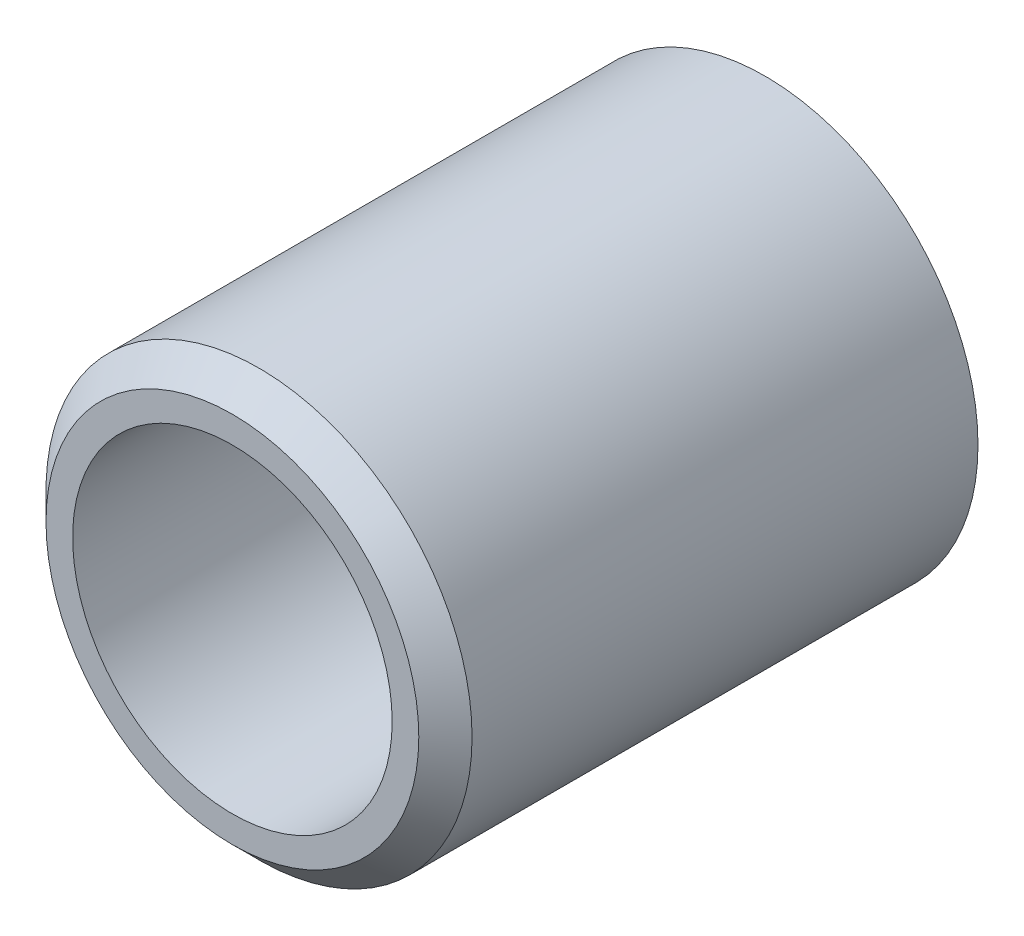
ISO-10303-21;
HEADER;
FILE_DESCRIPTION(('STEP AP214'),'2;1');
FILE_NAME('part.step','',(''),(''),'','','');
FILE_SCHEMA(('AUTOMOTIVE_DESIGN { 1 0 10303 214 1 1 1 1 }'));
ENDSEC;
DATA;
#1=APPLICATION_CONTEXT('core data for automotive mechanical design processes');
#2=APPLICATION_PROTOCOL_DEFINITION('international standard','automotive_design',2000,#1);
#3=PRODUCT_CONTEXT('',#1,'mechanical');
#4=PRODUCT('Part','Part','',(#3));
#5=PRODUCT_RELATED_PRODUCT_CATEGORY('part','',(#4));
#6=PRODUCT_DEFINITION_FORMATION('','',#4);
#7=PRODUCT_DEFINITION_CONTEXT('part definition',#1,'design');
#8=PRODUCT_DEFINITION('design','',#6,#7);
#9=PRODUCT_DEFINITION_SHAPE('','',#8);
#10=(LENGTH_UNIT() NAMED_UNIT(*) SI_UNIT(.MILLI.,.METRE.));
#11=(NAMED_UNIT(*) PLANE_ANGLE_UNIT() SI_UNIT($,.RADIAN.));
#12=(NAMED_UNIT(*) SI_UNIT($,.STERADIAN.) SOLID_ANGLE_UNIT());
#13=UNCERTAINTY_MEASURE_WITH_UNIT(LENGTH_MEASURE(1.E-05),#10,'distance_accuracy_value','');
#14=(GEOMETRIC_REPRESENTATION_CONTEXT(3) GLOBAL_UNCERTAINTY_ASSIGNED_CONTEXT((#13)) GLOBAL_UNIT_ASSIGNED_CONTEXT((#10,
#11,#12)) REPRESENTATION_CONTEXT('',''));
#15=CARTESIAN_POINT('',(0.,0.,0.));
#16=DIRECTION('',(0.,0.,1.));
#17=DIRECTION('',(1.,0.,0.));
#18=AXIS2_PLACEMENT_3D('',#15,#16,#17);
#19=CARTESIAN_POINT('',(0.,3.5,-10.));
#20=DIRECTION('',(0.,0.,1.));
#21=DIRECTION('',(1.,0.,0.));
#22=AXIS2_PLACEMENT_3D('',#19,#20,#21);
#23=PLANE('',#22);
#24=CARTESIAN_POINT('',(0.,0.,-10.));
#25=DIRECTION('',(0.,0.,1.));
#26=DIRECTION('',(1.,0.,0.));
#27=AXIS2_PLACEMENT_3D('',#24,#25,#26);
#28=CIRCLE('',#27,4.);
#29=CARTESIAN_POINT('',(4.,0.,-10.));
#30=VERTEX_POINT('',#29);
#31=EDGE_CURVE('E56',#30,#30,#28,.T.);
#32=ORIENTED_EDGE('',*,*,#31,.F.);
#33=EDGE_LOOP('',(#32));
#34=FACE_BOUND('',#33,.T.);
#35=CARTESIAN_POINT('',(0.,0.,-10.));
#36=DIRECTION('',(0.,0.,1.));
#37=DIRECTION('',(1.,0.,0.));
#38=AXIS2_PLACEMENT_3D('',#35,#36,#37);
#39=CIRCLE('',#38,3.5);
#40=CARTESIAN_POINT('',(3.5,0.,-10.));
#41=VERTEX_POINT('',#40);
#42=EDGE_CURVE('E10',#41,#41,#39,.T.);
#43=ORIENTED_EDGE('',*,*,#42,.T.);
#44=EDGE_LOOP('',(#43));
#45=FACE_BOUND('',#44,.T.);
#46=ADVANCED_FACE('F34',(#34,#45),#23,.F.);
#47=CARTESIAN_POINT('',(0.,0.,-9.5));
#48=DIRECTION('',(0.,0.,-1.));
#49=DIRECTION('',(-1.,0.,0.));
#50=AXIS2_PLACEMENT_3D('',#47,#48,#49);
#51=CONICAL_SURFACE('',#50,3.,0.785398163397448);
#52=ORIENTED_EDGE('',*,*,#42,.F.);
#53=EDGE_LOOP('',(#52));
#54=FACE_BOUND('',#53,.T.);
#55=CARTESIAN_POINT('',(0.,0.,-9.5));
#56=DIRECTION('',(0.,0.,1.));
#57=DIRECTION('',(1.,0.,0.));
#58=AXIS2_PLACEMENT_3D('',#55,#56,#57);
#59=CIRCLE('',#58,3.);
#60=CARTESIAN_POINT('',(3.,0.,-9.5));
#61=VERTEX_POINT('',#60);
#62=EDGE_CURVE('E40',#61,#61,#59,.T.);
#63=ORIENTED_EDGE('',*,*,#62,.T.);
#64=EDGE_LOOP('',(#63));
#65=FACE_BOUND('',#64,.T.);
#66=ADVANCED_FACE('F63',(#54,#65),#51,.F.);
#67=CARTESIAN_POINT('',(0.,0.,9.43693693693693));
#68=DIRECTION('',(0.,0.,1.));
#69=DIRECTION('',(1.,0.,0.));
#70=AXIS2_PLACEMENT_3D('',#67,#68,#69);
#71=CYLINDRICAL_SURFACE('',#70,3.);
#72=ORIENTED_EDGE('',*,*,#62,.F.);
#73=EDGE_LOOP('',(#72));
#74=FACE_BOUND('',#73,.T.);
#75=CARTESIAN_POINT('',(0.,0.,0.));
#76=DIRECTION('',(0.,0.,1.));
#77=DIRECTION('',(1.,0.,0.));
#78=AXIS2_PLACEMENT_3D('',#75,#76,#77);
#79=CIRCLE('',#78,3.);
#80=CARTESIAN_POINT('',(3.,0.,0.));
#81=VERTEX_POINT('',#80);
#82=EDGE_CURVE('E44',#81,#81,#79,.T.);
#83=ORIENTED_EDGE('',*,*,#82,.T.);
#84=EDGE_LOOP('',(#83));
#85=FACE_BOUND('',#84,.T.);
#86=ADVANCED_FACE('F67',(#74,#85),#71,.F.);
#87=CARTESIAN_POINT('',(0.,3.5,0.));
#88=DIRECTION('',(0.,0.,-1.));
#89=DIRECTION('',(-1.,0.,0.));
#90=AXIS2_PLACEMENT_3D('',#87,#88,#89);
#91=PLANE('',#90);
#92=ORIENTED_EDGE('',*,*,#82,.F.);
#93=EDGE_LOOP('',(#92));
#94=FACE_BOUND('',#93,.T.);
#95=CARTESIAN_POINT('',(0.,0.,0.));
#96=DIRECTION('',(0.,0.,1.));
#97=DIRECTION('',(1.,0.,0.));
#98=AXIS2_PLACEMENT_3D('',#95,#96,#97);
#99=CIRCLE('',#98,3.5);
#100=CARTESIAN_POINT('',(3.5,0.,0.));
#101=VERTEX_POINT('',#100);
#102=EDGE_CURVE('E48',#101,#101,#99,.T.);
#103=ORIENTED_EDGE('',*,*,#102,.T.);
#104=EDGE_LOOP('',(#103));
#105=FACE_BOUND('',#104,.T.);
#106=ADVANCED_FACE('F72',(#94,#105),#91,.F.);
#107=CARTESIAN_POINT('',(0.,0.,-0.5));
#108=DIRECTION('',(0.,0.,-1.));
#109=DIRECTION('',(-1.,0.,0.));
#110=AXIS2_PLACEMENT_3D('',#107,#108,#109);
#111=CONICAL_SURFACE('',#110,4.,0.785398163397448);
#112=ORIENTED_EDGE('',*,*,#102,.F.);
#113=EDGE_LOOP('',(#112));
#114=FACE_BOUND('',#113,.T.);
#115=CARTESIAN_POINT('',(0.,0.,-0.5));
#116=DIRECTION('',(0.,0.,1.));
#117=DIRECTION('',(1.,0.,0.));
#118=AXIS2_PLACEMENT_3D('',#115,#116,#117);
#119=CIRCLE('',#118,4.);
#120=CARTESIAN_POINT('',(4.,0.,-0.5));
#121=VERTEX_POINT('',#120);
#122=EDGE_CURVE('E53',#121,#121,#119,.T.);
#123=ORIENTED_EDGE('',*,*,#122,.T.);
#124=EDGE_LOOP('',(#123));
#125=FACE_BOUND('',#124,.T.);
#126=ADVANCED_FACE('F78',(#114,#125),#111,.T.);
#127=CARTESIAN_POINT('',(0.,0.,9.43693693693693));
#128=DIRECTION('',(0.,0.,1.));
#129=DIRECTION('',(1.,0.,0.));
#130=AXIS2_PLACEMENT_3D('',#127,#128,#129);
#131=CYLINDRICAL_SURFACE('',#130,4.);
#132=ORIENTED_EDGE('',*,*,#122,.F.);
#133=EDGE_LOOP('',(#132));
#134=FACE_BOUND('',#133,.T.);
#135=ORIENTED_EDGE('',*,*,#31,.T.);
#136=EDGE_LOOP('',(#135));
#137=FACE_BOUND('',#136,.T.);
#138=ADVANCED_FACE('F60',(#134,#137),#131,.T.);
#139=CLOSED_SHELL('',(#46,#66,#86,#106,#126,#138));
#140=MANIFOLD_SOLID_BREP('B2',#139);
#141=ADVANCED_BREP_SHAPE_REPRESENTATION('',(#18,#140),#14);
#142=SHAPE_DEFINITION_REPRESENTATION(#9,#141);
ENDSEC;
END-ISO-10303-21;
